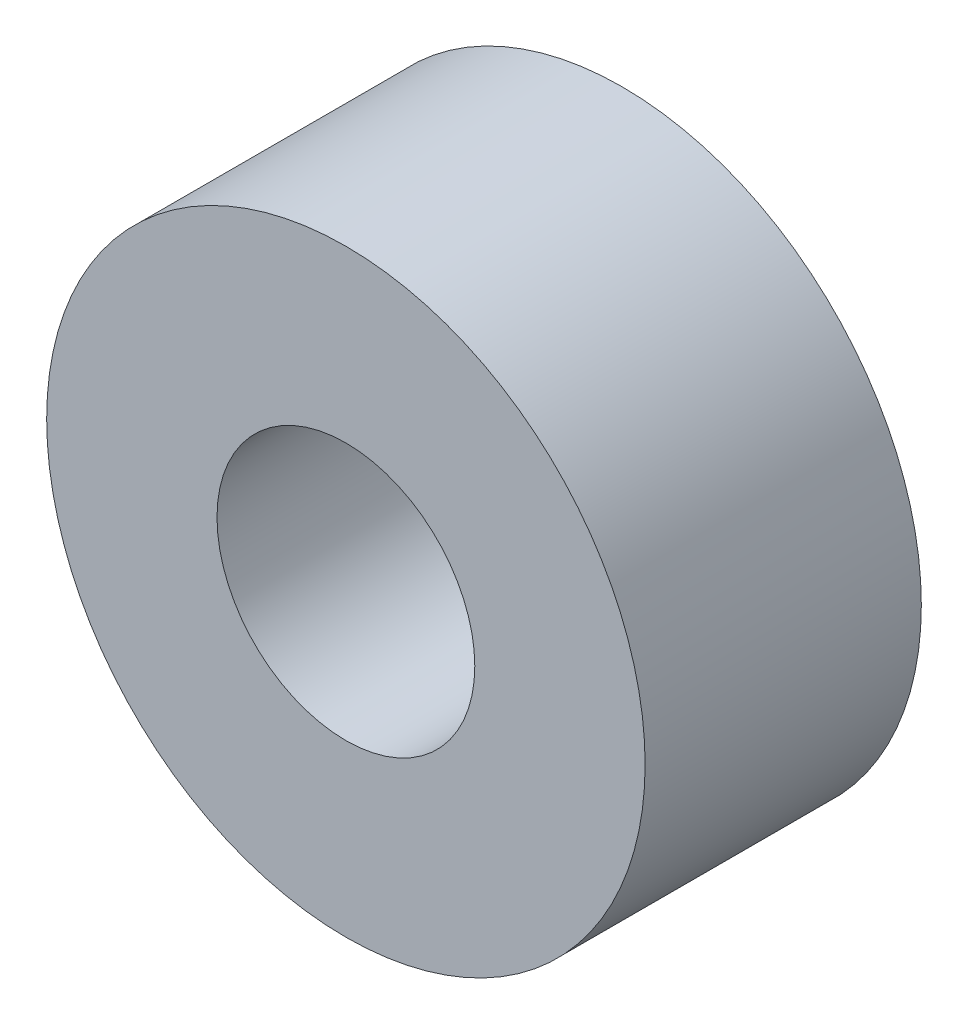
ISO-10303-21;
HEADER;
FILE_DESCRIPTION(('STEP AP214'),'2;1');
FILE_NAME('part.step','',(''),(''),'','','');
FILE_SCHEMA(('AUTOMOTIVE_DESIGN { 1 0 10303 214 1 1 1 1 }'));
ENDSEC;
DATA;
#1=APPLICATION_CONTEXT('core data for automotive mechanical design processes');
#2=APPLICATION_PROTOCOL_DEFINITION('international standard','automotive_design',2000,#1);
#3=PRODUCT_CONTEXT('',#1,'mechanical');
#4=PRODUCT('Part','Part','',(#3));
#5=PRODUCT_RELATED_PRODUCT_CATEGORY('part','',(#4));
#6=PRODUCT_DEFINITION_FORMATION('','',#4);
#7=PRODUCT_DEFINITION_CONTEXT('part definition',#1,'design');
#8=PRODUCT_DEFINITION('design','',#6,#7);
#9=PRODUCT_DEFINITION_SHAPE('','',#8);
#10=(LENGTH_UNIT() NAMED_UNIT(*) SI_UNIT(.MILLI.,.METRE.));
#11=(NAMED_UNIT(*) PLANE_ANGLE_UNIT() SI_UNIT($,.RADIAN.));
#12=(NAMED_UNIT(*) SI_UNIT($,.STERADIAN.) SOLID_ANGLE_UNIT());
#13=UNCERTAINTY_MEASURE_WITH_UNIT(LENGTH_MEASURE(1.E-05),#10,'distance_accuracy_value','');
#14=(GEOMETRIC_REPRESENTATION_CONTEXT(3) GLOBAL_UNCERTAINTY_ASSIGNED_CONTEXT((#13)) GLOBAL_UNIT_ASSIGNED_CONTEXT((#10,
#11,#12)) REPRESENTATION_CONTEXT('',''));
#15=CARTESIAN_POINT('',(0.,0.,0.));
#16=DIRECTION('',(0.,0.,1.));
#17=DIRECTION('',(1.,0.,0.));
#18=AXIS2_PLACEMENT_3D('',#15,#16,#17);
#19=CARTESIAN_POINT('',(0.,0.,3.));
#20=DIRECTION('',(0.,0.,1.));
#21=DIRECTION('',(1.,0.,0.));
#22=AXIS2_PLACEMENT_3D('',#19,#20,#21);
#23=PLANE('',#22);
#24=CARTESIAN_POINT('',(0.,0.,3.));
#25=DIRECTION('',(0.,0.,1.));
#26=DIRECTION('',(1.,0.,0.));
#27=AXIS2_PLACEMENT_3D('',#24,#25,#26);
#28=CIRCLE('',#27,3.25);
#29=CARTESIAN_POINT('',(3.25,0.,3.));
#30=VERTEX_POINT('',#29);
#31=EDGE_CURVE('E10',#30,#30,#28,.T.);
#32=ORIENTED_EDGE('',*,*,#31,.T.);
#33=EDGE_LOOP('',(#32));
#34=FACE_BOUND('',#33,.T.);
#35=CARTESIAN_POINT('',(0.,0.,3.));
#36=DIRECTION('',(0.,0.,1.));
#37=DIRECTION('',(1.,0.,0.));
#38=AXIS2_PLACEMENT_3D('',#35,#36,#37);
#39=CIRCLE('',#38,1.4);
#40=CARTESIAN_POINT('',(1.4,0.,3.));
#41=VERTEX_POINT('',#40);
#42=EDGE_CURVE('E42',#41,#41,#39,.T.);
#43=ORIENTED_EDGE('',*,*,#42,.F.);
#44=EDGE_LOOP('',(#43));
#45=FACE_BOUND('',#44,.T.);
#46=ADVANCED_FACE('F31',(#34,#45),#23,.T.);
#47=CARTESIAN_POINT('',(0.,0.,0.));
#48=DIRECTION('',(0.,0.,1.));
#49=DIRECTION('',(1.,0.,0.));
#50=AXIS2_PLACEMENT_3D('',#47,#48,#49);
#51=PLANE('',#50);
#52=CARTESIAN_POINT('',(0.,0.,0.));
#53=DIRECTION('',(0.,0.,1.));
#54=DIRECTION('',(1.,0.,0.));
#55=AXIS2_PLACEMENT_3D('',#52,#53,#54);
#56=CIRCLE('',#55,3.25);
#57=CARTESIAN_POINT('',(3.25,0.,0.));
#58=VERTEX_POINT('',#57);
#59=EDGE_CURVE('E35',#58,#58,#56,.T.);
#60=ORIENTED_EDGE('',*,*,#59,.F.);
#61=EDGE_LOOP('',(#60));
#62=FACE_BOUND('',#61,.T.);
#63=CARTESIAN_POINT('',(0.,0.,0.));
#64=DIRECTION('',(0.,0.,1.));
#65=DIRECTION('',(1.,0.,0.));
#66=AXIS2_PLACEMENT_3D('',#63,#64,#65);
#67=CIRCLE('',#66,1.4);
#68=CARTESIAN_POINT('',(1.4,0.,0.));
#69=VERTEX_POINT('',#68);
#70=EDGE_CURVE('E44',#69,#69,#67,.T.);
#71=ORIENTED_EDGE('',*,*,#70,.T.);
#72=EDGE_LOOP('',(#71));
#73=FACE_BOUND('',#72,.T.);
#74=ADVANCED_FACE('F54',(#62,#73),#51,.F.);
#75=CARTESIAN_POINT('',(0.,0.,3.));
#76=DIRECTION('',(0.,0.,-1.));
#77=DIRECTION('',(-1.,0.,0.));
#78=AXIS2_PLACEMENT_3D('',#75,#76,#77);
#79=CYLINDRICAL_SURFACE('',#78,3.25);
#80=ORIENTED_EDGE('',*,*,#31,.F.);
#81=EDGE_LOOP('',(#80));
#82=FACE_BOUND('',#81,.T.);
#83=ORIENTED_EDGE('',*,*,#59,.T.);
#84=EDGE_LOOP('',(#83));
#85=FACE_BOUND('',#84,.T.);
#86=ADVANCED_FACE('F33',(#82,#85),#79,.T.);
#87=CARTESIAN_POINT('',(0.,0.,3.));
#88=DIRECTION('',(0.,0.,-1.));
#89=DIRECTION('',(-1.,0.,0.));
#90=AXIS2_PLACEMENT_3D('',#87,#88,#89);
#91=CYLINDRICAL_SURFACE('',#90,1.4);
#92=ORIENTED_EDGE('',*,*,#42,.T.);
#93=EDGE_LOOP('',(#92));
#94=FACE_BOUND('',#93,.T.);
#95=ORIENTED_EDGE('',*,*,#70,.F.);
#96=EDGE_LOOP('',(#95));
#97=FACE_BOUND('',#96,.T.);
#98=ADVANCED_FACE('F50',(#94,#97),#91,.F.);
#99=CLOSED_SHELL('',(#46,#74,#86,#98));
#100=MANIFOLD_SOLID_BREP('B2',#99);
#101=ADVANCED_BREP_SHAPE_REPRESENTATION('',(#18,#100),#14);
#102=SHAPE_DEFINITION_REPRESENTATION(#9,#101);
ENDSEC;
END-ISO-10303-21;
